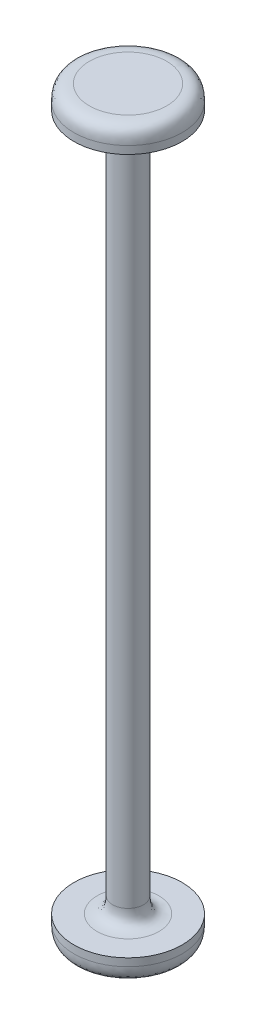
ISO-10303-21;
HEADER;
FILE_DESCRIPTION(('STEP AP214'),'2;1');
FILE_NAME('part.step','',(''),(''),'','','');
FILE_SCHEMA(('AUTOMOTIVE_DESIGN { 1 0 10303 214 1 1 1 1 }'));
ENDSEC;
DATA;
#1=APPLICATION_CONTEXT('core data for automotive mechanical design processes');
#2=APPLICATION_PROTOCOL_DEFINITION('international standard','automotive_design',2000,#1);
#3=PRODUCT_CONTEXT('',#1,'mechanical');
#4=PRODUCT('Part','Part','',(#3));
#5=PRODUCT_RELATED_PRODUCT_CATEGORY('part','',(#4));
#6=PRODUCT_DEFINITION_FORMATION('','',#4);
#7=PRODUCT_DEFINITION_CONTEXT('part definition',#1,'design');
#8=PRODUCT_DEFINITION('design','',#6,#7);
#9=PRODUCT_DEFINITION_SHAPE('','',#8);
#10=(LENGTH_UNIT() NAMED_UNIT(*) SI_UNIT(.MILLI.,.METRE.));
#11=(NAMED_UNIT(*) PLANE_ANGLE_UNIT() SI_UNIT($,.RADIAN.));
#12=(NAMED_UNIT(*) SI_UNIT($,.STERADIAN.) SOLID_ANGLE_UNIT());
#13=UNCERTAINTY_MEASURE_WITH_UNIT(LENGTH_MEASURE(1.E-05),#10,'distance_accuracy_value','');
#14=(GEOMETRIC_REPRESENTATION_CONTEXT(3) GLOBAL_UNCERTAINTY_ASSIGNED_CONTEXT((#13)) GLOBAL_UNIT_ASSIGNED_CONTEXT((#10,
#11,#12)) REPRESENTATION_CONTEXT('',''));
#15=CARTESIAN_POINT('',(0.,0.,0.));
#16=DIRECTION('',(0.,0.,1.));
#17=DIRECTION('',(1.,0.,0.));
#18=AXIS2_PLACEMENT_3D('',#15,#16,#17);
#19=CARTESIAN_POINT('',(0.,48.,0.));
#20=DIRECTION('',(0.,1.,0.));
#21=DIRECTION('',(0.,0.,1.));
#22=AXIS2_PLACEMENT_3D('',#19,#20,#21);
#23=PLANE('',#22);
#24=CARTESIAN_POINT('',(0.,48.,-5.));
#25=CARTESIAN_POINT('',(0.654410395691658,48.,-5.));
#26=CARTESIAN_POINT('',(1.96323118707499,48.,-4.73965935791022));
#27=CARTESIAN_POINT('',(3.6275782226528,48.,-3.62757822265281));
#28=CARTESIAN_POINT('',(4.73965935791023,48.,-1.96323118707497));
#29=CARTESIAN_POINT('',(5.13017032104488,48.,0.));
#30=CARTESIAN_POINT('',(4.73965935791023,48.,1.96323118707497));
#31=CARTESIAN_POINT('',(3.62757822265281,48.,3.62757822265281));
#32=CARTESIAN_POINT('',(1.96323118707497,48.,4.73965935791023));
#33=CARTESIAN_POINT('',(0.,48.,5.13017032104489));
#34=CARTESIAN_POINT('',(-1.96323118707497,48.,4.73965935791023));
#35=CARTESIAN_POINT('',(-3.6275782226528,48.,3.62757822265281));
#36=CARTESIAN_POINT('',(-4.73965935791023,48.,1.96323118707497));
#37=CARTESIAN_POINT('',(-5.13017032104489,48.,0.));
#38=CARTESIAN_POINT('',(-4.73965935791022,48.,-1.96323118707499));
#39=CARTESIAN_POINT('',(-3.62757822265281,48.,-3.6275782226528));
#40=CARTESIAN_POINT('',(-1.96323118707496,48.,-4.73965935791023));
#41=CARTESIAN_POINT('',(-0.654410395691657,48.,-5.));
#42=CARTESIAN_POINT('',(0.,48.,-5.));
#43=B_SPLINE_CURVE_WITH_KNOTS('',3,(#24,#25,#26,#27,#28,#29,#30,#31,#32,#33,#34,#35,#36,#37,#38,
#39,#40,#41,#42),.UNSPECIFIED.,.T.,.F.,(4,1,1,1,1,1,1,1,1,1,1,1,1,1,1,1,4),(-3.14159265358979,
-2.74889357189107,-2.35619449019234,-1.96349540849362,-1.5707963267949,-1.17809724509617,
-0.785398163397448,-0.392699081698724,0.,0.392699081698724,0.785398163397448,1.17809724509617,
1.5707963267949,1.96349540849362,2.35619449019235,2.74889357189107,3.14159265358979),.UNSPECIFIED.);
#44=CARTESIAN_POINT('',(0.,48.,-5.));
#45=VERTEX_POINT('',#44);
#46=EDGE_CURVE('E75',#45,#45,#43,.F.);
#47=ORIENTED_EDGE('',*,*,#46,.T.);
#48=EDGE_LOOP('',(#47));
#49=FACE_BOUND('',#48,.T.);
#50=ADVANCED_FACE('F37',(#49),#23,.T.);
#51=CARTESIAN_POINT('',(0.,-48.,0.));
#52=DIRECTION('',(0.,-1.,0.));
#53=DIRECTION('',(0.,0.,-1.));
#54=AXIS2_PLACEMENT_3D('',#51,#52,#53);
#55=CYLINDRICAL_SURFACE('',#54,7.);
#56=CARTESIAN_POINT('',(0.,46.,-7.));
#57=CARTESIAN_POINT('',(-0.916174553968319,46.,-7.));
#58=CARTESIAN_POINT('',(-2.74852366190494,46.0000000000001,-6.63552310107433));
#59=CARTESIAN_POINT('',(-5.07860951171394,46.,-5.07860951171391));
#60=CARTESIAN_POINT('',(-6.63552310107431,46.,-2.74852366190498));
#61=CARTESIAN_POINT('',(-7.18223844946284,46.,0.));
#62=CARTESIAN_POINT('',(-6.63552310107432,46.,2.74852366190496));
#63=CARTESIAN_POINT('',(-5.07860951171392,46.,5.07860951171394));
#64=CARTESIAN_POINT('',(-2.74852366190496,46.,6.63552310107432));
#65=CARTESIAN_POINT('',(0.,46.,7.18223844946284));
#66=CARTESIAN_POINT('',(2.74852366190496,46.,6.63552310107432));
#67=CARTESIAN_POINT('',(5.07860951171393,46.,5.07860951171393));
#68=CARTESIAN_POINT('',(6.63552310107432,46.,2.74852366190495));
#69=CARTESIAN_POINT('',(7.18223844946284,46.,0.));
#70=CARTESIAN_POINT('',(6.63552310107432,46.,-2.74852366190496));
#71=CARTESIAN_POINT('',(5.07860951171392,46.,-5.07860951171393));
#72=CARTESIAN_POINT('',(2.74852366190498,46.0000000000001,-6.63552310107431));
#73=CARTESIAN_POINT('',(0.916174553968321,46.,-7.));
#74=CARTESIAN_POINT('',(0.,46.,-7.));
#75=B_SPLINE_CURVE_WITH_KNOTS('',3,(#56,#57,#58,#59,#60,#61,#62,#63,#64,#65,#66,#67,#68,#69,#70,
#71,#72,#73,#74),.UNSPECIFIED.,.T.,.F.,(4,1,1,1,1,1,1,1,1,1,1,1,1,1,1,1,4),(-3.14159265358979,
-2.74889357189107,-2.35619449019235,-1.96349540849362,-1.5707963267949,-1.17809724509617,
-0.785398163397448,-0.392699081698724,0.,0.392699081698724,0.785398163397448,1.17809724509617,
1.5707963267949,1.96349540849362,2.35619449019234,2.74889357189107,3.14159265358979),.UNSPECIFIED.);
#76=CARTESIAN_POINT('',(0.,46.,-7.));
#77=VERTEX_POINT('',#76);
#78=EDGE_CURVE('E80',#77,#77,#75,.F.);
#79=ORIENTED_EDGE('',*,*,#78,.T.);
#80=EDGE_LOOP('',(#79));
#81=FACE_BOUND('',#80,.T.);
#82=CARTESIAN_POINT('',(0.,45.,0.));
#83=DIRECTION('',(0.,-1.,0.));
#84=DIRECTION('',(0.,0.,-1.));
#85=AXIS2_PLACEMENT_3D('',#82,#83,#84);
#86=CIRCLE('',#85,7.);
#87=CARTESIAN_POINT('',(0.,45.,-7.));
#88=VERTEX_POINT('',#87);
#89=EDGE_CURVE('E85',#88,#88,#86,.T.);
#90=ORIENTED_EDGE('',*,*,#89,.F.);
#91=EDGE_LOOP('',(#90));
#92=FACE_BOUND('',#91,.T.);
#93=ADVANCED_FACE('F101',(#81,#92),#55,.T.);
#94=CARTESIAN_POINT('',(0.,45.,-7.));
#95=DIRECTION('',(0.,-1.,0.));
#96=DIRECTION('',(0.,0.,-1.));
#97=AXIS2_PLACEMENT_3D('',#94,#95,#96);
#98=PLANE('',#97);
#99=CARTESIAN_POINT('',(0.,45.,-4.));
#100=CARTESIAN_POINT('',(1.04481549985497,45.,-4.));
#101=CARTESIAN_POINT('',(3.1344464995649,45.,-3.1344464995649));
#102=CARTESIAN_POINT('',(4.43277675021755,45.,0.));
#103=CARTESIAN_POINT('',(3.13444649956489,45.,3.1344464995649));
#104=CARTESIAN_POINT('',(0.,45.,4.43277675021755));
#105=CARTESIAN_POINT('',(-3.1344464995649,45.,3.1344464995649));
#106=CARTESIAN_POINT('',(-4.43277675021755,45.,0.));
#107=CARTESIAN_POINT('',(-3.13444649956491,45.,-3.13444649956488));
#108=CARTESIAN_POINT('',(-1.04481549985497,45.,-4.));
#109=CARTESIAN_POINT('',(0.,45.,-4.));
#110=B_SPLINE_CURVE_WITH_KNOTS('',3,(#99,#100,#101,#102,#103,#104,#105,#106,#107,#108,#109),
.UNSPECIFIED.,.T.,.F.,(4,1,1,1,1,1,1,1,4),(0.,0.785398163397448,1.5707963267949,
2.35619449019234,3.14159265358979,3.92699081698724,4.71238898038469,5.49778714378214,
6.28318530717959),.UNSPECIFIED.);
#111=CARTESIAN_POINT('',(0.,45.,-4.));
#112=VERTEX_POINT('',#111);
#113=EDGE_CURVE('E50',#112,#112,#110,.F.);
#114=ORIENTED_EDGE('',*,*,#113,.T.);
#115=EDGE_LOOP('',(#114));
#116=FACE_BOUND('',#115,.T.);
#117=ORIENTED_EDGE('',*,*,#89,.T.);
#118=EDGE_LOOP('',(#117));
#119=FACE_BOUND('',#118,.T.);
#120=ADVANCED_FACE('F111',(#116,#119),#98,.T.);
#121=CARTESIAN_POINT('',(0.,-48.,0.));
#122=DIRECTION('',(0.,-1.,0.));
#123=DIRECTION('',(0.,0.,-1.));
#124=AXIS2_PLACEMENT_3D('',#121,#122,#123);
#125=CYLINDRICAL_SURFACE('',#124,2.);
#126=CARTESIAN_POINT('',(0.,43.,-2.));
#127=CARTESIAN_POINT('',(-0.522407749927484,43.,-2.));
#128=CARTESIAN_POINT('',(-1.56722324978246,43.,-1.56722324978244));
#129=CARTESIAN_POINT('',(-2.21638837510877,43.,0.));
#130=CARTESIAN_POINT('',(-1.56722324978245,43.,1.56722324978245));
#131=CARTESIAN_POINT('',(0.,43.,2.21638837510877));
#132=CARTESIAN_POINT('',(1.56722324978245,43.,1.56722324978245));
#133=CARTESIAN_POINT('',(2.21638837510878,43.,0.));
#134=CARTESIAN_POINT('',(1.56722324978245,43.,-1.56722324978245));
#135=CARTESIAN_POINT('',(0.522407749927484,43.,-2.));
#136=CARTESIAN_POINT('',(0.,43.,-2.));
#137=B_SPLINE_CURVE_WITH_KNOTS('',3,(#126,#127,#128,#129,#130,#131,#132,#133,#134,#135,#136),
.UNSPECIFIED.,.T.,.F.,(4,1,1,1,1,1,1,1,4),(0.,0.785398163397448,1.5707963267949,
2.35619449019235,3.14159265358979,3.92699081698724,4.71238898038469,5.49778714378214,
6.28318530717959),.UNSPECIFIED.);
#138=CARTESIAN_POINT('',(0.,43.,-2.));
#139=VERTEX_POINT('',#138);
#140=EDGE_CURVE('E55',#139,#139,#137,.F.);
#141=ORIENTED_EDGE('',*,*,#140,.T.);
#142=EDGE_LOOP('',(#141));
#143=FACE_BOUND('',#142,.T.);
#144=CARTESIAN_POINT('',(0.,-43.,-2.));
#145=CARTESIAN_POINT('',(0.522407749927483,-43.,-2.));
#146=CARTESIAN_POINT('',(1.56722324978245,-43.,-1.56722324978245));
#147=CARTESIAN_POINT('',(2.21638837510878,-43.,0.));
#148=CARTESIAN_POINT('',(1.56722324978245,-43.,1.56722324978245));
#149=CARTESIAN_POINT('',(0.,-43.,2.21638837510878));
#150=CARTESIAN_POINT('',(-1.56722324978245,-43.,1.56722324978245));
#151=CARTESIAN_POINT('',(-2.21638837510878,-43.,0.));
#152=CARTESIAN_POINT('',(-1.56722324978245,-43.,-1.56722324978245));
#153=CARTESIAN_POINT('',(-0.522407749927482,-43.,-2.));
#154=CARTESIAN_POINT('',(0.,-43.,-2.));
#155=B_SPLINE_CURVE_WITH_KNOTS('',3,(#144,#145,#146,#147,#148,#149,#150,#151,#152,#153,#154),
.UNSPECIFIED.,.T.,.F.,(4,1,1,1,1,1,1,1,4),(-3.14159265358979,-2.35619449019234,-1.5707963267949,
-0.785398163397448,0.,0.785398163397448,1.5707963267949,2.35619449019234,3.14159265358979),.UNSPECIFIED.);
#156=CARTESIAN_POINT('',(0.,-43.,-2.));
#157=VERTEX_POINT('',#156);
#158=EDGE_CURVE('E60',#157,#157,#155,.F.);
#159=ORIENTED_EDGE('',*,*,#158,.T.);
#160=EDGE_LOOP('',(#159));
#161=FACE_BOUND('',#160,.T.);
#162=ADVANCED_FACE('F161',(#143,#161),#125,.T.);
#163=CARTESIAN_POINT('',(0.,-45.,-7.));
#164=DIRECTION('',(0.,1.,0.));
#165=DIRECTION('',(0.,0.,1.));
#166=AXIS2_PLACEMENT_3D('',#163,#164,#165);
#167=PLANE('',#166);
#168=CARTESIAN_POINT('',(0.,-45.,-4.));
#169=CARTESIAN_POINT('',(-1.04481549985497,-45.,-4.));
#170=CARTESIAN_POINT('',(-3.1344464995649,-45.,-3.1344464995649));
#171=CARTESIAN_POINT('',(-4.43277675021755,-45.,0.));
#172=CARTESIAN_POINT('',(-3.13444649956489,-45.,3.1344464995649));
#173=CARTESIAN_POINT('',(0.,-45.,4.43277675021755));
#174=CARTESIAN_POINT('',(3.1344464995649,-45.,3.1344464995649));
#175=CARTESIAN_POINT('',(4.43277675021755,-45.,0.));
#176=CARTESIAN_POINT('',(3.13444649956489,-45.,-3.1344464995649));
#177=CARTESIAN_POINT('',(1.04481549985497,-45.,-4.));
#178=CARTESIAN_POINT('',(0.,-45.,-4.));
#179=B_SPLINE_CURVE_WITH_KNOTS('',3,(#168,#169,#170,#171,#172,#173,#174,#175,#176,#177,#178),
.UNSPECIFIED.,.T.,.F.,(4,1,1,1,1,1,1,1,4),(-3.14159265358979,-2.35619449019234,-1.5707963267949,
-0.785398163397448,0.,0.785398163397448,1.5707963267949,2.35619449019234,3.14159265358979),.UNSPECIFIED.);
#180=CARTESIAN_POINT('',(0.,-45.,-4.));
#181=VERTEX_POINT('',#180);
#182=EDGE_CURVE('E10',#181,#181,#179,.F.);
#183=ORIENTED_EDGE('',*,*,#182,.T.);
#184=EDGE_LOOP('',(#183));
#185=FACE_BOUND('',#184,.T.);
#186=CARTESIAN_POINT('',(0.,-45.,0.));
#187=DIRECTION('',(0.,-1.,0.));
#188=DIRECTION('',(0.,0.,-1.));
#189=AXIS2_PLACEMENT_3D('',#186,#187,#188);
#190=CIRCLE('',#189,7.);
#191=CARTESIAN_POINT('',(0.,-45.,-7.));
#192=VERTEX_POINT('',#191);
#193=EDGE_CURVE('E90',#192,#192,#190,.T.);
#194=ORIENTED_EDGE('',*,*,#193,.F.);
#195=EDGE_LOOP('',(#194));
#196=FACE_BOUND('',#195,.T.);
#197=ADVANCED_FACE('F148',(#185,#196),#167,.T.);
#198=CARTESIAN_POINT('',(0.,-48.,0.));
#199=DIRECTION('',(0.,-1.,0.));
#200=DIRECTION('',(0.,0.,-1.));
#201=AXIS2_PLACEMENT_3D('',#198,#199,#200);
#202=CYLINDRICAL_SURFACE('',#201,7.);
#203=CARTESIAN_POINT('',(0.,-46.,-7.));
#204=CARTESIAN_POINT('',(0.916174553968321,-46.,-7.));
#205=CARTESIAN_POINT('',(2.74852366190496,-46.,-6.63552310107432));
#206=CARTESIAN_POINT('',(5.07860951171393,-46.,-5.07860951171393));
#207=CARTESIAN_POINT('',(6.63552310107432,-46.,-2.74852366190495));
#208=CARTESIAN_POINT('',(7.18223844946284,-46.,0.));
#209=CARTESIAN_POINT('',(6.63552310107432,-46.0000000000001,2.74852366190496));
#210=CARTESIAN_POINT('',(5.07860951171392,-46.,5.07860951171393));
#211=CARTESIAN_POINT('',(2.74852366190498,-46.,6.63552310107431));
#212=CARTESIAN_POINT('',(0.,-46.,7.18223844946284));
#213=CARTESIAN_POINT('',(-2.74852366190494,-46.,6.63552310107433));
#214=CARTESIAN_POINT('',(-5.07860951171394,-46.,5.07860951171392));
#215=CARTESIAN_POINT('',(-6.63552310107431,-46.,2.74852366190498));
#216=CARTESIAN_POINT('',(-7.18223844946284,-46.,0.));
#217=CARTESIAN_POINT('',(-6.63552310107432,-46.,-2.74852366190494));
#218=CARTESIAN_POINT('',(-5.07860951171395,-46.0000000000001,-5.07860951171392));
#219=CARTESIAN_POINT('',(-2.74852366190497,-46.,-6.63552310107432));
#220=CARTESIAN_POINT('',(-0.916174553968321,-46.,-7.));
#221=CARTESIAN_POINT('',(0.,-46.,-7.));
#222=B_SPLINE_CURVE_WITH_KNOTS('',3,(#203,#204,#205,#206,#207,#208,#209,#210,#211,#212,#213,
#214,#215,#216,#217,#218,#219,#220,#221),.UNSPECIFIED.,.T.,.F.,(4,1,1,1,1,1,1,1,1,1,1,1,1,1,1,1,
4),(0.,0.392699081698724,0.785398163397448,1.17809724509617,1.5707963267949,1.96349540849362,
2.35619449019234,2.74889357189107,3.14159265358979,3.53429173528852,3.92699081698724,
4.31968989868597,4.71238898038469,5.10508806208341,5.49778714378214,5.89048622548086,
6.28318530717959),.UNSPECIFIED.);
#223=CARTESIAN_POINT('',(0.,-46.,-7.));
#224=VERTEX_POINT('',#223);
#225=EDGE_CURVE('E65',#224,#224,#222,.F.);
#226=ORIENTED_EDGE('',*,*,#225,.T.);
#227=EDGE_LOOP('',(#226));
#228=FACE_BOUND('',#227,.T.);
#229=ORIENTED_EDGE('',*,*,#193,.T.);
#230=EDGE_LOOP('',(#229));
#231=FACE_BOUND('',#230,.T.);
#232=ADVANCED_FACE('F144',(#228,#231),#202,.T.);
#233=CARTESIAN_POINT('',(0.,-48.,0.));
#234=DIRECTION('',(0.,-1.,0.));
#235=DIRECTION('',(0.,0.,-1.));
#236=AXIS2_PLACEMENT_3D('',#233,#234,#235);
#237=PLANE('',#236);
#238=CARTESIAN_POINT('',(0.,-48.,-5.));
#239=CARTESIAN_POINT('',(-0.654410395691658,-48.,-5.));
#240=CARTESIAN_POINT('',(-1.96323118707498,-48.,-4.73965935791023));
#241=CARTESIAN_POINT('',(-3.62757822265282,-48.,-3.6275782226528));
#242=CARTESIAN_POINT('',(-4.73965935791023,-48.,-1.96323118707496));
#243=CARTESIAN_POINT('',(-5.13017032104489,-48.,0.));
#244=CARTESIAN_POINT('',(-4.73965935791022,-48.,1.96323118707499));
#245=CARTESIAN_POINT('',(-3.62757822265281,-48.,3.6275782226528));
#246=CARTESIAN_POINT('',(-1.96323118707496,-48.,4.73965935791023));
#247=CARTESIAN_POINT('',(0.,-48.,5.13017032104488));
#248=CARTESIAN_POINT('',(1.96323118707499,-48.,4.73965935791022));
#249=CARTESIAN_POINT('',(3.6275782226528,-48.,3.62757822265281));
#250=CARTESIAN_POINT('',(4.73965935791023,-48.,1.96323118707497));
#251=CARTESIAN_POINT('',(5.13017032104488,-48.,0.));
#252=CARTESIAN_POINT('',(4.73965935791023,-48.,-1.96323118707497));
#253=CARTESIAN_POINT('',(3.62757822265281,-48.,-3.62757822265281));
#254=CARTESIAN_POINT('',(1.96323118707497,-48.,-4.73965935791023));
#255=CARTESIAN_POINT('',(0.654410395691658,-48.,-5.));
#256=CARTESIAN_POINT('',(0.,-48.,-5.));
#257=B_SPLINE_CURVE_WITH_KNOTS('',3,(#238,#239,#240,#241,#242,#243,#244,#245,#246,#247,#248,
#249,#250,#251,#252,#253,#254,#255,#256),.UNSPECIFIED.,.T.,.F.,(4,1,1,1,1,1,1,1,1,1,1,1,1,1,1,1,
4),(0.,0.392699081698724,0.785398163397448,1.17809724509617,1.5707963267949,1.96349540849362,
2.35619449019235,2.74889357189107,3.14159265358979,3.53429173528852,3.92699081698724,
4.31968989868597,4.71238898038469,5.10508806208341,5.49778714378214,5.89048622548086,
6.28318530717959),.UNSPECIFIED.);
#258=CARTESIAN_POINT('',(0.,-48.,-5.));
#259=VERTEX_POINT('',#258);
#260=EDGE_CURVE('E70',#259,#259,#257,.F.);
#261=ORIENTED_EDGE('',*,*,#260,.T.);
#262=EDGE_LOOP('',(#261));
#263=FACE_BOUND('',#262,.T.);
#264=ADVANCED_FACE('F135',(#263),#237,.T.);
#265=CARTESIAN_POINT('',(0.,48.,-5.));
#266=CARTESIAN_POINT('',(-0.654410395691657,48.,-5.));
#267=CARTESIAN_POINT('',(-1.96323118707496,48.,-4.73965935791023));
#268=CARTESIAN_POINT('',(-3.62757822265281,48.,-3.6275782226528));
#269=CARTESIAN_POINT('',(-4.73965935791022,48.,-1.96323118707499));
#270=CARTESIAN_POINT('',(-5.13017032104489,48.,0.));
#271=CARTESIAN_POINT('',(-4.73965935791023,48.,1.96323118707497));
#272=CARTESIAN_POINT('',(-3.6275782226528,48.,3.62757822265281));
#273=CARTESIAN_POINT('',(-1.96323118707497,48.,4.73965935791023));
#274=CARTESIAN_POINT('',(0.,48.,5.13017032104489));
#275=CARTESIAN_POINT('',(1.96323118707497,48.,4.73965935791023));
#276=CARTESIAN_POINT('',(3.62757822265281,48.,3.62757822265281));
#277=CARTESIAN_POINT('',(4.73965935791023,48.,1.96323118707497));
#278=CARTESIAN_POINT('',(5.13017032104488,48.,0.));
#279=CARTESIAN_POINT('',(4.73965935791023,48.,-1.96323118707497));
#280=CARTESIAN_POINT('',(3.6275782226528,48.,-3.62757822265281));
#281=CARTESIAN_POINT('',(1.96323118707499,48.,-4.73965935791022));
#282=CARTESIAN_POINT('',(0.654410395691658,48.,-5.));
#283=CARTESIAN_POINT('',(0.,48.,-5.));
#284=CARTESIAN_POINT('',(0.,48.,-5.33639610306789));
#285=CARTESIAN_POINT('',(-0.698438617075215,48.,-5.33639610306789));
#286=CARTESIAN_POINT('',(-2.09531585122563,48.,-5.05853994548429));
#287=CARTESIAN_POINT('',(-3.87163885818768,48.,-3.87163885818767));
#288=CARTESIAN_POINT('',(-5.05853994548428,48.,-2.09531585122566));
#289=CARTESIAN_POINT('',(-5.4753241818597,48.,0.));
#290=CARTESIAN_POINT('',(-5.05853994548428,48.,2.09531585122564));
#291=CARTESIAN_POINT('',(-3.87163885818767,48.,3.87163885818768));
#292=CARTESIAN_POINT('',(-2.09531585122564,48.,5.05853994548428));
#293=CARTESIAN_POINT('',(0.,48.,5.4753241818597));
#294=CARTESIAN_POINT('',(2.09531585122565,48.,5.05853994548428));
#295=CARTESIAN_POINT('',(3.87163885818768,48.,3.87163885818768));
#296=CARTESIAN_POINT('',(5.05853994548428,48.,2.09531585122564));
#297=CARTESIAN_POINT('',(5.47532418185969,48.,0.));
#298=CARTESIAN_POINT('',(5.05853994548428,48.,-2.09531585122565));
#299=CARTESIAN_POINT('',(3.87163885818767,48.,-3.87163885818768));
#300=CARTESIAN_POINT('',(2.09531585122566,48.,-5.05853994548428));
#301=CARTESIAN_POINT('',(0.698438617075216,48.,-5.33639610306789));
#302=CARTESIAN_POINT('',(0.,48.,-5.33639610306789));
#303=CARTESIAN_POINT('',(0.,48.,-5.67279220613578));
#304=CARTESIAN_POINT('',(-0.742466838458773,48.,-5.67279220613579));
#305=CARTESIAN_POINT('',(-2.2274005153763,48.,-5.37742053305834));
#306=CARTESIAN_POINT('',(-4.11569949372256,48.,-4.11569949372254));
#307=CARTESIAN_POINT('',(-5.37742053305833,48.,-2.22740051537634));
#308=CARTESIAN_POINT('',(-5.82047804267451,48.,0.));
#309=CARTESIAN_POINT('',(-5.37742053305833,48.,2.22740051537632));
#310=CARTESIAN_POINT('',(-4.11569949372254,48.,4.11569949372256));
#311=CARTESIAN_POINT('',(-2.22740051537632,48.,5.37742053305833));
#312=CARTESIAN_POINT('',(0.,48.,5.82047804267451));
#313=CARTESIAN_POINT('',(2.22740051537632,48.,5.37742053305833));
#314=CARTESIAN_POINT('',(4.11569949372255,48.,4.11569949372255));
#315=CARTESIAN_POINT('',(5.37742053305834,48.,2.22740051537632));
#316=CARTESIAN_POINT('',(5.82047804267451,48.,0.));
#317=CARTESIAN_POINT('',(5.37742053305834,48.,-2.22740051537632));
#318=CARTESIAN_POINT('',(4.11569949372254,48.,-4.11569949372255));
#319=CARTESIAN_POINT('',(2.22740051537634,48.,-5.37742053305833));
#320=CARTESIAN_POINT('',(0.742466838458774,48.,-5.67279220613578));
#321=CARTESIAN_POINT('',(0.,48.,-5.67279220613578));
#322=CARTESIAN_POINT('',(0.,47.8566161603278,-6.4142135623731));
#323=CARTESIAN_POINT('',(-0.839505607080674,47.8566161603278,-6.4142135623731));
#324=CARTESIAN_POINT('',(-2.518516821242,47.8566161603278,-6.08023746690728));
#325=CARTESIAN_POINT('',(-4.65361228686179,47.8566161603278,-4.65361228686177));
#326=CARTESIAN_POINT('',(-6.08023746690726,47.8566161603278,-2.51851682124204));
#327=CARTESIAN_POINT('',(-6.58120161010601,47.8566161603278,0.));
#328=CARTESIAN_POINT('',(-6.08023746690728,47.8566161603278,2.51851682124202));
#329=CARTESIAN_POINT('',(-4.65361228686178,47.8566161603278,4.65361228686179));
#330=CARTESIAN_POINT('',(-2.51851682124202,47.8566161603278,6.08023746690727));
#331=CARTESIAN_POINT('',(0.,47.8566161603278,6.58120161010601));
#332=CARTESIAN_POINT('',(2.51851682124202,47.8566161603278,6.08023746690727));
#333=CARTESIAN_POINT('',(4.65361228686179,47.8566161603278,4.65361228686179));
#334=CARTESIAN_POINT('',(6.08023746690727,47.8566161603278,2.51851682124202));
#335=CARTESIAN_POINT('',(6.58120161010601,47.8566161603278,0.));
#336=CARTESIAN_POINT('',(6.08023746690728,47.8566161603278,-2.51851682124203));
#337=CARTESIAN_POINT('',(4.65361228686177,47.8566161603278,-4.65361228686179));
#338=CARTESIAN_POINT('',(2.51851682124204,47.8566161603278,-6.08023746690726));
#339=CARTESIAN_POINT('',(0.839505607080675,47.8566161603278,-6.41421356237309));
#340=CARTESIAN_POINT('',(0.,47.8566161603278,-6.4142135623731));
#341=CARTESIAN_POINT('',(0.,47.4142135623731,-6.85661616032784));
#342=CARTESIAN_POINT('',(-0.89740817891719,47.4142135623731,-6.85661616032784));
#343=CARTESIAN_POINT('',(-2.69222453675155,47.4142135623731,-6.49960498957928));
#344=CARTESIAN_POINT('',(-4.97458229285892,47.4142135623731,-4.9745822928589));
#345=CARTESIAN_POINT('',(-6.49960498957926,47.4142135623731,-2.69222453675159));
#346=CARTESIAN_POINT('',(-7.03512174570213,47.4142135623731,0.));
#347=CARTESIAN_POINT('',(-6.49960498957926,47.4142135623731,2.69222453675157));
#348=CARTESIAN_POINT('',(-4.97458229285891,47.4142135623731,4.97458229285892));
#349=CARTESIAN_POINT('',(-2.69222453675157,47.4142135623731,6.49960498957927));
#350=CARTESIAN_POINT('',(0.,47.4142135623731,7.03512174570213));
#351=CARTESIAN_POINT('',(2.69222453675157,47.4142135623731,6.49960498957926));
#352=CARTESIAN_POINT('',(4.97458229285891,47.4142135623731,4.97458229285892));
#353=CARTESIAN_POINT('',(6.49960498957927,47.4142135623731,2.69222453675157));
#354=CARTESIAN_POINT('',(7.03512174570213,47.4142135623731,0.));
#355=CARTESIAN_POINT('',(6.49960498957926,47.4142135623731,-2.69222453675157));
#356=CARTESIAN_POINT('',(4.97458229285891,47.4142135623731,-4.97458229285892));
#357=CARTESIAN_POINT('',(2.69222453675159,47.4142135623731,-6.49960498957926));
#358=CARTESIAN_POINT('',(0.897408178917192,47.4142135623731,-6.85661616032784));
#359=CARTESIAN_POINT('',(0.,47.4142135623731,-6.85661616032784));
#360=CARTESIAN_POINT('',(0.,46.6727922061358,-7.));
#361=CARTESIAN_POINT('',(-0.916174553968319,46.6727922061358,-7.));
#362=CARTESIAN_POINT('',(-2.74852366190494,46.6727922061358,-6.63552310107433));
#363=CARTESIAN_POINT('',(-5.07860951171394,46.6727922061358,-5.07860951171392));
#364=CARTESIAN_POINT('',(-6.63552310107431,46.6727922061358,-2.74852366190498));
#365=CARTESIAN_POINT('',(-7.18223844946284,46.6727922061358,0.));
#366=CARTESIAN_POINT('',(-6.63552310107432,46.6727922061358,2.74852366190496));
#367=CARTESIAN_POINT('',(-5.07860951171393,46.6727922061358,5.07860951171394));
#368=CARTESIAN_POINT('',(-2.74852366190496,46.6727922061358,6.63552310107432));
#369=CARTESIAN_POINT('',(0.,46.6727922061358,7.18223844946284));
#370=CARTESIAN_POINT('',(2.74852366190496,46.6727922061358,6.63552310107432));
#371=CARTESIAN_POINT('',(5.07860951171393,46.6727922061358,5.07860951171393));
#372=CARTESIAN_POINT('',(6.63552310107432,46.6727922061358,2.74852366190495));
#373=CARTESIAN_POINT('',(7.18223844946284,46.6727922061358,0.));
#374=CARTESIAN_POINT('',(6.63552310107432,46.6727922061358,-2.74852366190496));
#375=CARTESIAN_POINT('',(5.07860951171392,46.6727922061358,-5.07860951171393));
#376=CARTESIAN_POINT('',(2.74852366190498,46.6727922061358,-6.63552310107431));
#377=CARTESIAN_POINT('',(0.916174553968321,46.6727922061358,-7.));
#378=CARTESIAN_POINT('',(0.,46.6727922061358,-7.));
#379=CARTESIAN_POINT('',(0.,46.3363961030679,-7.));
#380=CARTESIAN_POINT('',(-0.916174553968319,46.3363961030679,-7.));
#381=CARTESIAN_POINT('',(-2.74852366190494,46.3363961030679,-6.63552310107433));
#382=CARTESIAN_POINT('',(-5.07860951171394,46.3363961030679,-5.07860951171392));
#383=CARTESIAN_POINT('',(-6.63552310107431,46.3363961030679,-2.74852366190498));
#384=CARTESIAN_POINT('',(-7.18223844946284,46.3363961030679,0.));
#385=CARTESIAN_POINT('',(-6.63552310107432,46.3363961030679,2.74852366190496));
#386=CARTESIAN_POINT('',(-5.07860951171393,46.3363961030679,5.07860951171394));
#387=CARTESIAN_POINT('',(-2.74852366190496,46.3363961030679,6.63552310107432));
#388=CARTESIAN_POINT('',(0.,46.3363961030679,7.18223844946284));
#389=CARTESIAN_POINT('',(2.74852366190496,46.3363961030679,6.63552310107432));
#390=CARTESIAN_POINT('',(5.07860951171393,46.3363961030679,5.07860951171393));
#391=CARTESIAN_POINT('',(6.63552310107432,46.3363961030679,2.74852366190495));
#392=CARTESIAN_POINT('',(7.18223844946284,46.3363961030679,0.));
#393=CARTESIAN_POINT('',(6.63552310107432,46.3363961030679,-2.74852366190496));
#394=CARTESIAN_POINT('',(5.07860951171392,46.3363961030679,-5.07860951171393));
#395=CARTESIAN_POINT('',(2.74852366190498,46.3363961030679,-6.63552310107431));
#396=CARTESIAN_POINT('',(0.916174553968321,46.3363961030679,-7.));
#397=CARTESIAN_POINT('',(0.,46.3363961030679,-7.));
#398=CARTESIAN_POINT('',(0.,46.,-7.));
#399=CARTESIAN_POINT('',(-0.916174553968319,46.,-7.));
#400=CARTESIAN_POINT('',(-2.74852366190494,46.,-6.63552310107433));
#401=CARTESIAN_POINT('',(-5.07860951171394,46.,-5.07860951171391));
#402=CARTESIAN_POINT('',(-6.63552310107431,46.,-2.74852366190498));
#403=CARTESIAN_POINT('',(-7.18223844946284,46.,0.));
#404=CARTESIAN_POINT('',(-6.63552310107432,46.,2.74852366190496));
#405=CARTESIAN_POINT('',(-5.07860951171392,46.,5.07860951171394));
#406=CARTESIAN_POINT('',(-2.74852366190496,46.,6.63552310107432));
#407=CARTESIAN_POINT('',(0.,46.,7.18223844946284));
#408=CARTESIAN_POINT('',(2.74852366190496,46.,6.63552310107432));
#409=CARTESIAN_POINT('',(5.07860951171393,46.,5.07860951171393));
#410=CARTESIAN_POINT('',(6.63552310107432,46.,2.74852366190495));
#411=CARTESIAN_POINT('',(7.18223844946284,46.,0.));
#412=CARTESIAN_POINT('',(6.63552310107432,46.,-2.74852366190496));
#413=CARTESIAN_POINT('',(5.07860951171392,46.,-5.07860951171393));
#414=CARTESIAN_POINT('',(2.74852366190498,46.,-6.63552310107431));
#415=CARTESIAN_POINT('',(0.916174553968321,46.,-7.));
#416=CARTESIAN_POINT('',(0.,46.,-7.));
#417=B_SPLINE_SURFACE_WITH_KNOTS('',5,3,((#265,#266,#267,#268,#269,#270,#271,#272,#273,#274,
#275,#276,#277,#278,#279,#280,#281,#282,#283),(#284,#285,#286,#287,#288,#289,#290,#291,#292,
#293,#294,#295,#296,#297,#298,#299,#300,#301,#302),(#303,#304,#305,#306,#307,#308,#309,#310,
#311,#312,#313,#314,#315,#316,#317,#318,#319,#320,#321),(#322,#323,#324,#325,#326,#327,#328,
#329,#330,#331,#332,#333,#334,#335,#336,#337,#338,#339,#340),(#341,#342,#343,#344,#345,#346,
#347,#348,#349,#350,#351,#352,#353,#354,#355,#356,#357,#358,#359),(#360,#361,#362,#363,#364,
#365,#366,#367,#368,#369,#370,#371,#372,#373,#374,#375,#376,#377,#378),(#379,#380,#381,#382,
#383,#384,#385,#386,#387,#388,#389,#390,#391,#392,#393,#394,#395,#396,#397),(#398,#399,#400,
#401,#402,#403,#404,#405,#406,#407,#408,#409,#410,#411,#412,#413,#414,#415,#416)),.UNSPECIFIED.,
.F.,.T.,.F.,(6,2,6),(4,1,1,1,1,1,1,1,1,1,1,1,1,1,1,1,4),(0.,0.5,1.),(-3.14159265358979,
-2.74889357189107,-2.35619449019235,-1.96349540849362,-1.5707963267949,-1.17809724509617,
-0.785398163397448,-0.392699081698724,0.,0.392699081698724,0.785398163397448,1.17809724509617,
1.5707963267949,1.96349540849362,2.35619449019234,2.74889357189107,3.14159265358979),.UNSPECIFIED.);
#418=ORIENTED_EDGE('',*,*,#46,.F.);
#419=EDGE_LOOP('',(#418));
#420=FACE_BOUND('',#419,.T.);
#421=ORIENTED_EDGE('',*,*,#78,.F.);
#422=EDGE_LOOP('',(#421));
#423=FACE_BOUND('',#422,.T.);
#424=ADVANCED_FACE('F118',(#420,#423),#417,.T.);
#425=CARTESIAN_POINT('',(0.,-48.,-5.));
#426=CARTESIAN_POINT('',(0.654410395691658,-48.,-5.));
#427=CARTESIAN_POINT('',(1.96323118707497,-48.,-4.73965935791023));
#428=CARTESIAN_POINT('',(3.62757822265281,-48.,-3.62757822265281));
#429=CARTESIAN_POINT('',(4.73965935791023,-48.,-1.96323118707497));
#430=CARTESIAN_POINT('',(5.13017032104488,-48.,0.));
#431=CARTESIAN_POINT('',(4.73965935791023,-48.,1.96323118707497));
#432=CARTESIAN_POINT('',(3.6275782226528,-48.,3.62757822265281));
#433=CARTESIAN_POINT('',(1.96323118707499,-48.,4.73965935791022));
#434=CARTESIAN_POINT('',(0.,-48.,5.13017032104488));
#435=CARTESIAN_POINT('',(-1.96323118707496,-48.,4.73965935791023));
#436=CARTESIAN_POINT('',(-3.62757822265281,-48.,3.6275782226528));
#437=CARTESIAN_POINT('',(-4.73965935791022,-48.,1.96323118707499));
#438=CARTESIAN_POINT('',(-5.13017032104489,-48.,0.));
#439=CARTESIAN_POINT('',(-4.73965935791023,-48.,-1.96323118707496));
#440=CARTESIAN_POINT('',(-3.62757822265282,-48.,-3.6275782226528));
#441=CARTESIAN_POINT('',(-1.96323118707498,-48.,-4.73965935791023));
#442=CARTESIAN_POINT('',(-0.654410395691658,-48.,-5.));
#443=CARTESIAN_POINT('',(0.,-48.,-5.));
#444=CARTESIAN_POINT('',(0.,-48.,-5.33639610306789));
#445=CARTESIAN_POINT('',(0.698438617075216,-48.,-5.33639610306789));
#446=CARTESIAN_POINT('',(2.09531585122565,-48.,-5.05853994548428));
#447=CARTESIAN_POINT('',(3.87163885818768,-48.,-3.87163885818768));
#448=CARTESIAN_POINT('',(5.05853994548428,-48.,-2.09531585122564));
#449=CARTESIAN_POINT('',(5.47532418185969,-48.,0.));
#450=CARTESIAN_POINT('',(5.05853994548428,-48.,2.09531585122565));
#451=CARTESIAN_POINT('',(3.87163885818767,-48.,3.87163885818768));
#452=CARTESIAN_POINT('',(2.09531585122566,-48.,5.05853994548428));
#453=CARTESIAN_POINT('',(0.,-48.,5.47532418185969));
#454=CARTESIAN_POINT('',(-2.09531585122563,-48.,5.05853994548429));
#455=CARTESIAN_POINT('',(-3.87163885818769,-48.,3.87163885818767));
#456=CARTESIAN_POINT('',(-5.05853994548427,-48.,2.09531585122566));
#457=CARTESIAN_POINT('',(-5.4753241818597,-48.,0.));
#458=CARTESIAN_POINT('',(-5.05853994548428,-48.,-2.09531585122563));
#459=CARTESIAN_POINT('',(-3.87163885818769,-48.,-3.87163885818767));
#460=CARTESIAN_POINT('',(-2.09531585122565,-48.,-5.05853994548428));
#461=CARTESIAN_POINT('',(-0.698438617075216,-48.,-5.33639610306789));
#462=CARTESIAN_POINT('',(0.,-48.,-5.33639610306789));
#463=CARTESIAN_POINT('',(0.,-48.,-5.67279220613578));
#464=CARTESIAN_POINT('',(0.742466838458774,-48.,-5.67279220613578));
#465=CARTESIAN_POINT('',(2.22740051537632,-48.,-5.37742053305833));
#466=CARTESIAN_POINT('',(4.11569949372255,-48.,-4.11569949372255));
#467=CARTESIAN_POINT('',(5.37742053305834,-48.,-2.22740051537632));
#468=CARTESIAN_POINT('',(5.82047804267451,-48.,0.));
#469=CARTESIAN_POINT('',(5.37742053305834,-48.,2.22740051537632));
#470=CARTESIAN_POINT('',(4.11569949372254,-48.,4.11569949372255));
#471=CARTESIAN_POINT('',(2.22740051537634,-48.,5.37742053305833));
#472=CARTESIAN_POINT('',(0.,-48.,5.82047804267451));
#473=CARTESIAN_POINT('',(-2.2274005153763,-48.,5.37742053305834));
#474=CARTESIAN_POINT('',(-4.11569949372256,-48.,4.11569949372254));
#475=CARTESIAN_POINT('',(-5.37742053305833,-48.,2.22740051537634));
#476=CARTESIAN_POINT('',(-5.82047804267451,-48.,0.));
#477=CARTESIAN_POINT('',(-5.37742053305834,-48.,-2.2274005153763));
#478=CARTESIAN_POINT('',(-4.11569949372257,-48.,-4.11569949372254));
#479=CARTESIAN_POINT('',(-2.22740051537632,-48.,-5.37742053305833));
#480=CARTESIAN_POINT('',(-0.742466838458774,-48.,-5.67279220613578));
#481=CARTESIAN_POINT('',(0.,-48.,-5.67279220613578));
#482=CARTESIAN_POINT('',(0.,-47.8566161603278,-6.4142135623731));
#483=CARTESIAN_POINT('',(0.839505607080675,-47.8566161603278,-6.4142135623731));
#484=CARTESIAN_POINT('',(2.51851682124202,-47.8566161603278,-6.08023746690727));
#485=CARTESIAN_POINT('',(4.65361228686179,-47.8566161603278,-4.65361228686179));
#486=CARTESIAN_POINT('',(6.08023746690727,-47.8566161603278,-2.51851682124202));
#487=CARTESIAN_POINT('',(6.58120161010601,-47.8566161603278,0.));
#488=CARTESIAN_POINT('',(6.08023746690728,-47.8566161603278,2.51851682124203));
#489=CARTESIAN_POINT('',(4.65361228686177,-47.8566161603278,4.65361228686179));
#490=CARTESIAN_POINT('',(2.51851682124204,-47.8566161603278,6.08023746690726));
#491=CARTESIAN_POINT('',(0.,-47.8566161603278,6.58120161010601));
#492=CARTESIAN_POINT('',(-2.518516821242,-47.8566161603278,6.08023746690728));
#493=CARTESIAN_POINT('',(-4.6536122868618,-47.8566161603278,4.65361228686177));
#494=CARTESIAN_POINT('',(-6.08023746690726,-47.8566161603278,2.51851682124204));
#495=CARTESIAN_POINT('',(-6.58120161010601,-47.8566161603278,0.));
#496=CARTESIAN_POINT('',(-6.08023746690727,-47.8566161603278,-2.518516821242));
#497=CARTESIAN_POINT('',(-4.6536122868618,-47.8566161603279,-4.65361228686178));
#498=CARTESIAN_POINT('',(-2.51851682124203,-47.8566161603278,-6.08023746690727));
#499=CARTESIAN_POINT('',(-0.839505607080675,-47.8566161603278,-6.4142135623731));
#500=CARTESIAN_POINT('',(0.,-47.8566161603278,-6.4142135623731));
#501=CARTESIAN_POINT('',(0.,-47.4142135623731,-6.85661616032784));
#502=CARTESIAN_POINT('',(0.897408178917192,-47.4142135623731,-6.85661616032784));
#503=CARTESIAN_POINT('',(2.69222453675157,-47.4142135623731,-6.49960498957927));
#504=CARTESIAN_POINT('',(4.97458229285891,-47.4142135623731,-4.97458229285892));
#505=CARTESIAN_POINT('',(6.49960498957927,-47.4142135623731,-2.69222453675157));
#506=CARTESIAN_POINT('',(7.03512174570213,-47.4142135623731,0.));
#507=CARTESIAN_POINT('',(6.49960498957926,-47.4142135623731,2.69222453675157));
#508=CARTESIAN_POINT('',(4.97458229285891,-47.4142135623731,4.97458229285892));
#509=CARTESIAN_POINT('',(2.69222453675159,-47.4142135623731,6.49960498957926));
#510=CARTESIAN_POINT('',(0.,-47.4142135623731,7.03512174570212));
#511=CARTESIAN_POINT('',(-2.69222453675155,-47.4142135623731,6.49960498957928));
#512=CARTESIAN_POINT('',(-4.97458229285893,-47.4142135623731,4.9745822928589));
#513=CARTESIAN_POINT('',(-6.49960498957926,-47.4142135623731,2.69222453675159));
#514=CARTESIAN_POINT('',(-7.03512174570213,-47.4142135623731,0.));
#515=CARTESIAN_POINT('',(-6.49960498957927,-47.4142135623731,-2.69222453675155));
#516=CARTESIAN_POINT('',(-4.97458229285893,-47.4142135623731,-4.9745822928589));
#517=CARTESIAN_POINT('',(-2.69222453675158,-47.4142135623731,-6.49960498957927));
#518=CARTESIAN_POINT('',(-0.897408178917191,-47.4142135623731,-6.85661616032784));
#519=CARTESIAN_POINT('',(0.,-47.4142135623731,-6.85661616032784));
#520=CARTESIAN_POINT('',(0.,-46.6727922061358,-7.));
#521=CARTESIAN_POINT('',(0.916174553968321,-46.6727922061358,-7.));
#522=CARTESIAN_POINT('',(2.74852366190496,-46.6727922061358,-6.63552310107432));
#523=CARTESIAN_POINT('',(5.07860951171393,-46.6727922061358,-5.07860951171393));
#524=CARTESIAN_POINT('',(6.63552310107432,-46.6727922061358,-2.74852366190495));
#525=CARTESIAN_POINT('',(7.18223844946284,-46.6727922061358,0.));
#526=CARTESIAN_POINT('',(6.63552310107432,-46.6727922061358,2.74852366190496));
#527=CARTESIAN_POINT('',(5.07860951171392,-46.6727922061358,5.07860951171393));
#528=CARTESIAN_POINT('',(2.74852366190498,-46.6727922061358,6.63552310107431));
#529=CARTESIAN_POINT('',(0.,-46.6727922061358,7.18223844946284));
#530=CARTESIAN_POINT('',(-2.74852366190494,-46.6727922061358,6.63552310107433));
#531=CARTESIAN_POINT('',(-5.07860951171394,-46.6727922061358,5.07860951171392));
#532=CARTESIAN_POINT('',(-6.63552310107431,-46.6727922061358,2.74852366190498));
#533=CARTESIAN_POINT('',(-7.18223844946284,-46.6727922061358,0.));
#534=CARTESIAN_POINT('',(-6.63552310107432,-46.6727922061358,-2.74852366190494));
#535=CARTESIAN_POINT('',(-5.07860951171395,-46.6727922061358,-5.07860951171392));
#536=CARTESIAN_POINT('',(-2.74852366190497,-46.6727922061358,-6.63552310107432));
#537=CARTESIAN_POINT('',(-0.916174553968321,-46.6727922061358,-7.));
#538=CARTESIAN_POINT('',(0.,-46.6727922061358,-7.));
#539=CARTESIAN_POINT('',(0.,-46.3363961030679,-7.));
#540=CARTESIAN_POINT('',(0.916174553968321,-46.3363961030679,-7.));
#541=CARTESIAN_POINT('',(2.74852366190496,-46.3363961030679,-6.63552310107432));
#542=CARTESIAN_POINT('',(5.07860951171393,-46.3363961030679,-5.07860951171393));
#543=CARTESIAN_POINT('',(6.63552310107432,-46.3363961030679,-2.74852366190495));
#544=CARTESIAN_POINT('',(7.18223844946284,-46.3363961030679,0.));
#545=CARTESIAN_POINT('',(6.63552310107432,-46.3363961030679,2.74852366190496));
#546=CARTESIAN_POINT('',(5.07860951171392,-46.3363961030679,5.07860951171393));
#547=CARTESIAN_POINT('',(2.74852366190498,-46.3363961030679,6.63552310107431));
#548=CARTESIAN_POINT('',(0.,-46.3363961030679,7.18223844946284));
#549=CARTESIAN_POINT('',(-2.74852366190494,-46.3363961030679,6.63552310107433));
#550=CARTESIAN_POINT('',(-5.07860951171394,-46.3363961030679,5.07860951171392));
#551=CARTESIAN_POINT('',(-6.63552310107431,-46.3363961030679,2.74852366190498));
#552=CARTESIAN_POINT('',(-7.18223844946284,-46.3363961030679,0.));
#553=CARTESIAN_POINT('',(-6.63552310107432,-46.3363961030679,-2.74852366190494));
#554=CARTESIAN_POINT('',(-5.07860951171395,-46.3363961030679,-5.07860951171392));
#555=CARTESIAN_POINT('',(-2.74852366190497,-46.3363961030679,-6.63552310107432));
#556=CARTESIAN_POINT('',(-0.916174553968321,-46.3363961030679,-7.));
#557=CARTESIAN_POINT('',(0.,-46.3363961030679,-7.));
#558=CARTESIAN_POINT('',(0.,-46.,-7.));
#559=CARTESIAN_POINT('',(0.916174553968321,-46.,-7.));
#560=CARTESIAN_POINT('',(2.74852366190496,-46.,-6.63552310107432));
#561=CARTESIAN_POINT('',(5.07860951171393,-46.,-5.07860951171393));
#562=CARTESIAN_POINT('',(6.63552310107432,-46.,-2.74852366190495));
#563=CARTESIAN_POINT('',(7.18223844946284,-46.,0.));
#564=CARTESIAN_POINT('',(6.63552310107432,-46.,2.74852366190496));
#565=CARTESIAN_POINT('',(5.07860951171392,-46.,5.07860951171393));
#566=CARTESIAN_POINT('',(2.74852366190498,-46.,6.63552310107431));
#567=CARTESIAN_POINT('',(0.,-46.,7.18223844946284));
#568=CARTESIAN_POINT('',(-2.74852366190494,-46.,6.63552310107433));
#569=CARTESIAN_POINT('',(-5.07860951171394,-46.,5.07860951171392));
#570=CARTESIAN_POINT('',(-6.63552310107431,-46.,2.74852366190498));
#571=CARTESIAN_POINT('',(-7.18223844946284,-46.,0.));
#572=CARTESIAN_POINT('',(-6.63552310107432,-46.,-2.74852366190494));
#573=CARTESIAN_POINT('',(-5.07860951171395,-46.,-5.07860951171392));
#574=CARTESIAN_POINT('',(-2.74852366190497,-46.,-6.63552310107432));
#575=CARTESIAN_POINT('',(-0.916174553968321,-46.,-7.));
#576=CARTESIAN_POINT('',(0.,-46.,-7.));
#577=B_SPLINE_SURFACE_WITH_KNOTS('',5,3,((#425,#426,#427,#428,#429,#430,#431,#432,#433,#434,
#435,#436,#437,#438,#439,#440,#441,#442,#443),(#444,#445,#446,#447,#448,#449,#450,#451,#452,
#453,#454,#455,#456,#457,#458,#459,#460,#461,#462),(#463,#464,#465,#466,#467,#468,#469,#470,
#471,#472,#473,#474,#475,#476,#477,#478,#479,#480,#481),(#482,#483,#484,#485,#486,#487,#488,
#489,#490,#491,#492,#493,#494,#495,#496,#497,#498,#499,#500),(#501,#502,#503,#504,#505,#506,
#507,#508,#509,#510,#511,#512,#513,#514,#515,#516,#517,#518,#519),(#520,#521,#522,#523,#524,
#525,#526,#527,#528,#529,#530,#531,#532,#533,#534,#535,#536,#537,#538),(#539,#540,#541,#542,
#543,#544,#545,#546,#547,#548,#549,#550,#551,#552,#553,#554,#555,#556,#557),(#558,#559,#560,
#561,#562,#563,#564,#565,#566,#567,#568,#569,#570,#571,#572,#573,#574,#575,#576)),.UNSPECIFIED.,
.F.,.T.,.F.,(6,2,6),(4,1,1,1,1,1,1,1,1,1,1,1,1,1,1,1,4),(0.,0.5,1.),(0.,0.392699081698724,
0.785398163397448,1.17809724509617,1.5707963267949,1.96349540849362,2.35619449019234,
2.74889357189107,3.14159265358979,3.53429173528852,3.92699081698724,4.31968989868597,
4.71238898038469,5.10508806208341,5.49778714378214,5.89048622548086,6.28318530717959),.UNSPECIFIED.);
#578=ORIENTED_EDGE('',*,*,#225,.F.);
#579=EDGE_LOOP('',(#578));
#580=FACE_BOUND('',#579,.T.);
#581=ORIENTED_EDGE('',*,*,#260,.F.);
#582=EDGE_LOOP('',(#581));
#583=FACE_BOUND('',#582,.T.);
#584=ADVANCED_FACE('F221',(#580,#583),#577,.T.);
#585=CARTESIAN_POINT('',(0.,43.,-2.));
#586=CARTESIAN_POINT('',(0.522407749927484,43.,-2.));
#587=CARTESIAN_POINT('',(1.56722324978245,43.,-1.56722324978245));
#588=CARTESIAN_POINT('',(2.21638837510878,43.,0.));
#589=CARTESIAN_POINT('',(1.56722324978245,43.,1.56722324978245));
#590=CARTESIAN_POINT('',(0.,43.,2.21638837510877));
#591=CARTESIAN_POINT('',(-1.56722324978245,43.,1.56722324978245));
#592=CARTESIAN_POINT('',(-2.21638837510877,43.,0.));
#593=CARTESIAN_POINT('',(-1.56722324978246,43.,-1.56722324978244));
#594=CARTESIAN_POINT('',(-0.522407749927484,43.,-2.));
#595=CARTESIAN_POINT('',(0.,43.,-2.));
#596=CARTESIAN_POINT('',(0.,43.3363961030679,-2.));
#597=CARTESIAN_POINT('',(0.522407749927484,43.3363961030679,-2.));
#598=CARTESIAN_POINT('',(1.56722324978245,43.3363961030679,-1.56722324978245));
#599=CARTESIAN_POINT('',(2.21638837510878,43.3363961030679,0.));
#600=CARTESIAN_POINT('',(1.56722324978244,43.3363961030679,1.56722324978245));
#601=CARTESIAN_POINT('',(0.,43.3363961030679,2.21638837510877));
#602=CARTESIAN_POINT('',(-1.56722324978245,43.3363961030679,1.56722324978245));
#603=CARTESIAN_POINT('',(-2.21638837510877,43.3363961030679,0.));
#604=CARTESIAN_POINT('',(-1.56722324978246,43.3363961030679,-1.56722324978244));
#605=CARTESIAN_POINT('',(-0.522407749927484,43.3363961030679,-2.));
#606=CARTESIAN_POINT('',(0.,43.3363961030679,-2.));
#607=CARTESIAN_POINT('',(0.,43.6727922061358,-2.));
#608=CARTESIAN_POINT('',(0.522407749927483,43.6727922061358,-2.));
#609=CARTESIAN_POINT('',(1.56722324978245,43.6727922061358,-1.56722324978245));
#610=CARTESIAN_POINT('',(2.21638837510878,43.6727922061358,0.));
#611=CARTESIAN_POINT('',(1.56722324978244,43.6727922061358,1.56722324978245));
#612=CARTESIAN_POINT('',(0.,43.6727922061358,2.21638837510877));
#613=CARTESIAN_POINT('',(-1.56722324978245,43.6727922061358,1.56722324978245));
#614=CARTESIAN_POINT('',(-2.21638837510877,43.6727922061358,0.));
#615=CARTESIAN_POINT('',(-1.56722324978245,43.6727922061358,-1.56722324978244));
#616=CARTESIAN_POINT('',(-0.522407749927484,43.6727922061358,-2.));
#617=CARTESIAN_POINT('',(0.,43.6727922061358,-2.));
#618=CARTESIAN_POINT('',(0.,44.4142135623731,-2.14338383967216));
#619=CARTESIAN_POINT('',(0.559860164457032,44.4142135623731,-2.14338383967216));
#620=CARTESIAN_POINT('',(1.67958049337109,44.4142135623731,-1.67958049337109));
#621=CARTESIAN_POINT('',(2.37528551282269,44.4142135623731,0.));
#622=CARTESIAN_POINT('',(1.67958049337109,44.4142135623731,1.6795804933711));
#623=CARTESIAN_POINT('',(0.,44.4142135623731,2.37528551282269));
#624=CARTESIAN_POINT('',(-1.67958049337109,44.4142135623731,1.67958049337109));
#625=CARTESIAN_POINT('',(-2.37528551282269,44.4142135623731,0.));
#626=CARTESIAN_POINT('',(-1.6795804933711,44.4142135623731,-1.67958049337108));
#627=CARTESIAN_POINT('',(-0.559860164457033,44.4142135623731,-2.14338383967216));
#628=CARTESIAN_POINT('',(0.,44.4142135623731,-2.14338383967216));
#629=CARTESIAN_POINT('',(0.,44.8566161603278,-2.5857864376269));
#630=CARTESIAN_POINT('',(0.675417437336837,44.8566161603278,-2.5857864376269));
#631=CARTESIAN_POINT('',(2.02625231201051,44.8566161603278,-2.02625231201051));
#632=CARTESIAN_POINT('',(2.8655535004351,44.8566161603278,0.));
#633=CARTESIAN_POINT('',(2.0262523120105,44.8566161603278,2.02625231201051));
#634=CARTESIAN_POINT('',(0.,44.8566161603278,2.8655535004351));
#635=CARTESIAN_POINT('',(-2.02625231201051,44.8566161603278,2.02625231201051));
#636=CARTESIAN_POINT('',(-2.8655535004351,44.8566161603278,0.));
#637=CARTESIAN_POINT('',(-2.02625231201052,44.8566161603278,-2.0262523120105));
#638=CARTESIAN_POINT('',(-0.675417437336837,44.8566161603278,-2.5857864376269));
#639=CARTESIAN_POINT('',(0.,44.8566161603278,-2.5857864376269));
#640=CARTESIAN_POINT('',(0.,45.,-3.32720779386422));
#641=CARTESIAN_POINT('',(0.869079568566896,45.,-3.32720779386422));
#642=CARTESIAN_POINT('',(2.60723870570068,45.,-2.60723870570068));
#643=CARTESIAN_POINT('',(3.68719233794598,45.,0.));
#644=CARTESIAN_POINT('',(2.60723870570068,45.,2.60723870570069));
#645=CARTESIAN_POINT('',(0.,45.,3.68719233794598));
#646=CARTESIAN_POINT('',(-2.60723870570069,45.,2.60723870570069));
#647=CARTESIAN_POINT('',(-3.68719233794598,45.,0.));
#648=CARTESIAN_POINT('',(-2.6072387057007,45.,-2.60723870570067));
#649=CARTESIAN_POINT('',(-0.869079568566897,45.,-3.32720779386421));
#650=CARTESIAN_POINT('',(0.,45.,-3.32720779386422));
#651=CARTESIAN_POINT('',(0.,45.,-3.66360389693211));
#652=CARTESIAN_POINT('',(0.956947534210932,45.,-3.66360389693211));
#653=CARTESIAN_POINT('',(2.87084260263279,45.,-2.87084260263279));
#654=CARTESIAN_POINT('',(4.05998454408177,45.,0.));
#655=CARTESIAN_POINT('',(2.87084260263279,45.,2.87084260263279));
#656=CARTESIAN_POINT('',(0.,45.,4.05998454408176));
#657=CARTESIAN_POINT('',(-2.87084260263279,45.,2.87084260263279));
#658=CARTESIAN_POINT('',(-4.05998454408176,45.,0.));
#659=CARTESIAN_POINT('',(-2.87084260263281,45.,-2.87084260263277));
#660=CARTESIAN_POINT('',(-0.956947534210932,45.,-3.66360389693211));
#661=CARTESIAN_POINT('',(0.,45.,-3.66360389693211));
#662=CARTESIAN_POINT('',(0.,45.,-4.));
#663=CARTESIAN_POINT('',(1.04481549985497,45.,-4.));
#664=CARTESIAN_POINT('',(3.1344464995649,45.,-3.1344464995649));
#665=CARTESIAN_POINT('',(4.43277675021755,45.,0.));
#666=CARTESIAN_POINT('',(3.13444649956489,45.,3.1344464995649));
#667=CARTESIAN_POINT('',(0.,45.,4.43277675021755));
#668=CARTESIAN_POINT('',(-3.1344464995649,45.,3.1344464995649));
#669=CARTESIAN_POINT('',(-4.43277675021755,45.,0.));
#670=CARTESIAN_POINT('',(-3.13444649956491,45.,-3.13444649956488));
#671=CARTESIAN_POINT('',(-1.04481549985497,45.,-4.));
#672=CARTESIAN_POINT('',(0.,45.,-4.));
#673=B_SPLINE_SURFACE_WITH_KNOTS('',5,3,((#585,#586,#587,#588,#589,#590,#591,#592,#593,#594,
#595),(#596,#597,#598,#599,#600,#601,#602,#603,#604,#605,#606),(#607,#608,#609,#610,#611,#612,
#613,#614,#615,#616,#617),(#618,#619,#620,#621,#622,#623,#624,#625,#626,#627,#628),(#629,#630,
#631,#632,#633,#634,#635,#636,#637,#638,#639),(#640,#641,#642,#643,#644,#645,#646,#647,#648,
#649,#650),(#651,#652,#653,#654,#655,#656,#657,#658,#659,#660,#661),(#662,#663,#664,#665,#666,
#667,#668,#669,#670,#671,#672)),.UNSPECIFIED.,.F.,.T.,.F.,(6,2,6),(4,1,1,1,1,1,1,1,4),(0.,0.5,
1.),(0.,0.785398163397448,1.5707963267949,2.35619449019234,3.14159265358979,3.92699081698724,
4.71238898038469,5.49778714378214,6.28318530717959),.UNSPECIFIED.);
#674=ORIENTED_EDGE('',*,*,#113,.F.);
#675=EDGE_LOOP('',(#674));
#676=FACE_BOUND('',#675,.T.);
#677=ORIENTED_EDGE('',*,*,#140,.F.);
#678=EDGE_LOOP('',(#677));
#679=FACE_BOUND('',#678,.T.);
#680=ADVANCED_FACE('F234',(#676,#679),#673,.T.);
#681=CARTESIAN_POINT('',(0.,-43.,-2.));
#682=CARTESIAN_POINT('',(-0.522407749927482,-43.,-2.));
#683=CARTESIAN_POINT('',(-1.56722324978245,-43.,-1.56722324978245));
#684=CARTESIAN_POINT('',(-2.21638837510878,-43.,0.));
#685=CARTESIAN_POINT('',(-1.56722324978245,-43.,1.56722324978245));
#686=CARTESIAN_POINT('',(0.,-43.,2.21638837510878));
#687=CARTESIAN_POINT('',(1.56722324978245,-43.,1.56722324978245));
#688=CARTESIAN_POINT('',(2.21638837510878,-43.,0.));
#689=CARTESIAN_POINT('',(1.56722324978245,-43.,-1.56722324978245));
#690=CARTESIAN_POINT('',(0.522407749927483,-43.,-2.));
#691=CARTESIAN_POINT('',(0.,-43.,-2.));
#692=CARTESIAN_POINT('',(0.,-43.3363961030679,-2.));
#693=CARTESIAN_POINT('',(-0.522407749927482,-43.3363961030679,-2.));
#694=CARTESIAN_POINT('',(-1.56722324978245,-43.3363961030679,-1.56722324978245));
#695=CARTESIAN_POINT('',(-2.21638837510877,-43.3363961030679,0.));
#696=CARTESIAN_POINT('',(-1.56722324978245,-43.3363961030679,1.56722324978245));
#697=CARTESIAN_POINT('',(0.,-43.3363961030679,2.21638837510878));
#698=CARTESIAN_POINT('',(1.56722324978245,-43.3363961030679,1.56722324978245));
#699=CARTESIAN_POINT('',(2.21638837510878,-43.3363961030679,0.));
#700=CARTESIAN_POINT('',(1.56722324978245,-43.3363961030679,-1.56722324978245));
#701=CARTESIAN_POINT('',(0.522407749927483,-43.3363961030679,-2.));
#702=CARTESIAN_POINT('',(0.,-43.3363961030679,-2.));
#703=CARTESIAN_POINT('',(0.,-43.6727922061358,-2.));
#704=CARTESIAN_POINT('',(-0.522407749927482,-43.6727922061358,-2.));
#705=CARTESIAN_POINT('',(-1.56722324978245,-43.6727922061358,-1.56722324978245));
#706=CARTESIAN_POINT('',(-2.21638837510877,-43.6727922061358,0.));
#707=CARTESIAN_POINT('',(-1.56722324978244,-43.6727922061358,1.56722324978245));
#708=CARTESIAN_POINT('',(0.,-43.6727922061358,2.21638837510877));
#709=CARTESIAN_POINT('',(1.56722324978245,-43.6727922061358,1.56722324978245));
#710=CARTESIAN_POINT('',(2.21638837510878,-43.6727922061358,0.));
#711=CARTESIAN_POINT('',(1.56722324978244,-43.6727922061358,-1.56722324978245));
#712=CARTESIAN_POINT('',(0.522407749927482,-43.6727922061358,-2.));
#713=CARTESIAN_POINT('',(0.,-43.6727922061358,-2.));
#714=CARTESIAN_POINT('',(0.,-44.4142135623731,-2.14338383967216));
#715=CARTESIAN_POINT('',(-0.559860164457031,-44.4142135623731,-2.14338383967216));
#716=CARTESIAN_POINT('',(-1.67958049337109,-44.4142135623731,-1.67958049337109));
#717=CARTESIAN_POINT('',(-2.37528551282269,-44.4142135623731,0.));
#718=CARTESIAN_POINT('',(-1.67958049337109,-44.4142135623731,1.67958049337109));
#719=CARTESIAN_POINT('',(0.,-44.4142135623731,2.37528551282269));
#720=CARTESIAN_POINT('',(1.67958049337109,-44.4142135623731,1.67958049337109));
#721=CARTESIAN_POINT('',(2.37528551282269,-44.4142135623731,0.));
#722=CARTESIAN_POINT('',(1.67958049337109,-44.4142135623731,-1.6795804933711));
#723=CARTESIAN_POINT('',(0.559860164457031,-44.4142135623731,-2.14338383967216));
#724=CARTESIAN_POINT('',(0.,-44.4142135623731,-2.14338383967216));
#725=CARTESIAN_POINT('',(0.,-44.8566161603278,-2.5857864376269));
#726=CARTESIAN_POINT('',(-0.675417437336835,-44.8566161603278,-2.5857864376269));
#727=CARTESIAN_POINT('',(-2.02625231201051,-44.8566161603278,-2.02625231201051));
#728=CARTESIAN_POINT('',(-2.8655535004351,-44.8566161603278,0.));
#729=CARTESIAN_POINT('',(-2.02625231201051,-44.8566161603278,2.02625231201051));
#730=CARTESIAN_POINT('',(0.,-44.8566161603278,2.8655535004351));
#731=CARTESIAN_POINT('',(2.02625231201051,-44.8566161603278,2.02625231201051));
#732=CARTESIAN_POINT('',(2.8655535004351,-44.8566161603278,0.));
#733=CARTESIAN_POINT('',(2.0262523120105,-44.8566161603278,-2.02625231201051));
#734=CARTESIAN_POINT('',(0.675417437336836,-44.8566161603278,-2.5857864376269));
#735=CARTESIAN_POINT('',(0.,-44.8566161603278,-2.5857864376269));
#736=CARTESIAN_POINT('',(0.,-45.,-3.32720779386422));
#737=CARTESIAN_POINT('',(-0.869079568566894,-45.,-3.32720779386421));
#738=CARTESIAN_POINT('',(-2.60723870570069,-45.,-2.60723870570068));
#739=CARTESIAN_POINT('',(-3.68719233794598,-45.,0.));
#740=CARTESIAN_POINT('',(-2.60723870570068,-45.,2.60723870570069));
#741=CARTESIAN_POINT('',(0.,-45.,3.68719233794598));
#742=CARTESIAN_POINT('',(2.60723870570068,-45.,2.60723870570068));
#743=CARTESIAN_POINT('',(3.68719233794598,-45.,0.));
#744=CARTESIAN_POINT('',(2.60723870570068,-45.,-2.60723870570069));
#745=CARTESIAN_POINT('',(0.869079568566895,-45.,-3.32720779386422));
#746=CARTESIAN_POINT('',(0.,-45.,-3.32720779386422));
#747=CARTESIAN_POINT('',(0.,-45.,-3.66360389693211));
#748=CARTESIAN_POINT('',(-0.95694753421093,-45.,-3.66360389693211));
#749=CARTESIAN_POINT('',(-2.87084260263279,-45.,-2.87084260263279));
#750=CARTESIAN_POINT('',(-4.05998454408177,-45.,0.));
#751=CARTESIAN_POINT('',(-2.87084260263279,-45.,2.87084260263279));
#752=CARTESIAN_POINT('',(0.,-45.,4.05998454408177));
#753=CARTESIAN_POINT('',(2.87084260263279,-45.,2.87084260263279));
#754=CARTESIAN_POINT('',(4.05998454408177,-45.,0.));
#755=CARTESIAN_POINT('',(2.87084260263279,-45.,-2.87084260263279));
#756=CARTESIAN_POINT('',(0.956947534210931,-45.,-3.66360389693211));
#757=CARTESIAN_POINT('',(0.,-45.,-3.66360389693211));
#758=CARTESIAN_POINT('',(0.,-45.,-4.));
#759=CARTESIAN_POINT('',(-1.04481549985497,-45.,-4.));
#760=CARTESIAN_POINT('',(-3.1344464995649,-45.,-3.1344464995649));
#761=CARTESIAN_POINT('',(-4.43277675021755,-45.,0.));
#762=CARTESIAN_POINT('',(-3.13444649956489,-45.,3.1344464995649));
#763=CARTESIAN_POINT('',(0.,-45.,4.43277675021755));
#764=CARTESIAN_POINT('',(3.1344464995649,-45.,3.1344464995649));
#765=CARTESIAN_POINT('',(4.43277675021755,-45.,0.));
#766=CARTESIAN_POINT('',(3.13444649956489,-45.,-3.1344464995649));
#767=CARTESIAN_POINT('',(1.04481549985497,-45.,-4.));
#768=CARTESIAN_POINT('',(0.,-45.,-4.));
#769=B_SPLINE_SURFACE_WITH_KNOTS('',5,3,((#681,#682,#683,#684,#685,#686,#687,#688,#689,#690,
#691),(#692,#693,#694,#695,#696,#697,#698,#699,#700,#701,#702),(#703,#704,#705,#706,#707,#708,
#709,#710,#711,#712,#713),(#714,#715,#716,#717,#718,#719,#720,#721,#722,#723,#724),(#725,#726,
#727,#728,#729,#730,#731,#732,#733,#734,#735),(#736,#737,#738,#739,#740,#741,#742,#743,#744,
#745,#746),(#747,#748,#749,#750,#751,#752,#753,#754,#755,#756,#757),(#758,#759,#760,#761,#762,
#763,#764,#765,#766,#767,#768)),.UNSPECIFIED.,.F.,.T.,.F.,(6,2,6),(4,1,1,1,1,1,1,1,4),(0.,0.5,
1.),(-3.14159265358979,-2.35619449019234,-1.5707963267949,-0.785398163397448,0.,
0.785398163397448,1.5707963267949,2.35619449019234,3.14159265358979),.UNSPECIFIED.);
#770=ORIENTED_EDGE('',*,*,#158,.F.);
#771=EDGE_LOOP('',(#770));
#772=FACE_BOUND('',#771,.T.);
#773=ORIENTED_EDGE('',*,*,#182,.F.);
#774=EDGE_LOOP('',(#773));
#775=FACE_BOUND('',#774,.T.);
#776=ADVANCED_FACE('F40',(#772,#775),#769,.T.);
#777=CLOSED_SHELL('',(#50,#93,#120,#162,#197,#232,#264,#424,#584,#680,#776));
#778=MANIFOLD_SOLID_BREP('B2',#777);
#779=ADVANCED_BREP_SHAPE_REPRESENTATION('',(#18,#778),#14);
#780=SHAPE_DEFINITION_REPRESENTATION(#9,#779);
ENDSEC;
END-ISO-10303-21;
